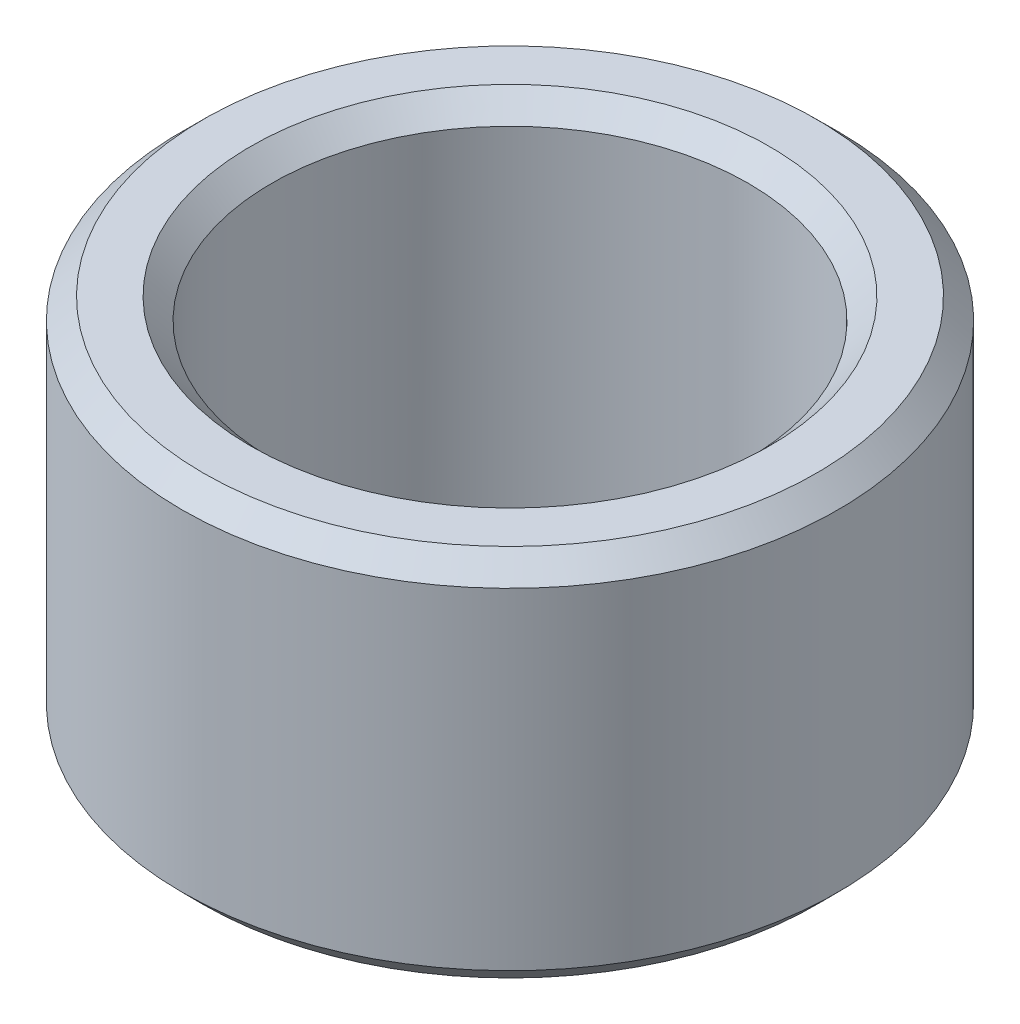
ISO-10303-21;
HEADER;
FILE_DESCRIPTION(('STEP AP214'),'2;1');
FILE_NAME('part.step','',(''),(''),'','','');
FILE_SCHEMA(('AUTOMOTIVE_DESIGN { 1 0 10303 214 1 1 1 1 }'));
ENDSEC;
DATA;
#1=APPLICATION_CONTEXT('core data for automotive mechanical design processes');
#2=APPLICATION_PROTOCOL_DEFINITION('international standard','automotive_design',2000,#1);
#3=PRODUCT_CONTEXT('',#1,'mechanical');
#4=PRODUCT('Part','Part','',(#3));
#5=PRODUCT_RELATED_PRODUCT_CATEGORY('part','',(#4));
#6=PRODUCT_DEFINITION_FORMATION('','',#4);
#7=PRODUCT_DEFINITION_CONTEXT('part definition',#1,'design');
#8=PRODUCT_DEFINITION('design','',#6,#7);
#9=PRODUCT_DEFINITION_SHAPE('','',#8);
#10=(LENGTH_UNIT() NAMED_UNIT(*) SI_UNIT(.MILLI.,.METRE.));
#11=(NAMED_UNIT(*) PLANE_ANGLE_UNIT() SI_UNIT($,.RADIAN.));
#12=(NAMED_UNIT(*) SI_UNIT($,.STERADIAN.) SOLID_ANGLE_UNIT());
#13=UNCERTAINTY_MEASURE_WITH_UNIT(LENGTH_MEASURE(1.E-05),#10,'distance_accuracy_value','');
#14=(GEOMETRIC_REPRESENTATION_CONTEXT(3) GLOBAL_UNCERTAINTY_ASSIGNED_CONTEXT((#13)) GLOBAL_UNIT_ASSIGNED_CONTEXT((#10,
#11,#12)) REPRESENTATION_CONTEXT('',''));
#15=CARTESIAN_POINT('',(0.,0.,0.));
#16=DIRECTION('',(0.,0.,1.));
#17=DIRECTION('',(1.,0.,0.));
#18=AXIS2_PLACEMENT_3D('',#15,#16,#17);
#19=CARTESIAN_POINT('',(0.,28.4884845648745,0.));
#20=DIRECTION('',(0.,-1.,0.));
#21=DIRECTION('',(0.,0.,-1.));
#22=AXIS2_PLACEMENT_3D('',#19,#20,#21);
#23=CYLINDRICAL_SURFACE('',#22,25.);
#24=CARTESIAN_POINT('',(0.,1.6250385084784,0.));
#25=DIRECTION('',(0.,1.,0.));
#26=DIRECTION('',(0.,0.,1.));
#27=AXIS2_PLACEMENT_3D('',#24,#25,#26);
#28=CIRCLE('',#27,25.);
#29=CARTESIAN_POINT('',(0.,1.6250385084784,25.));
#30=VERTEX_POINT('',#29);
#31=EDGE_CURVE('E10',#30,#30,#28,.T.);
#32=ORIENTED_EDGE('',*,*,#31,.T.);
#33=EDGE_LOOP('',(#32));
#34=FACE_BOUND('',#33,.T.);
#35=CARTESIAN_POINT('',(0.,26.8729493379577,0.));
#36=DIRECTION('',(0.,1.,0.));
#37=DIRECTION('',(0.,0.,1.));
#38=AXIS2_PLACEMENT_3D('',#35,#36,#37);
#39=CIRCLE('',#38,25.);
#40=CARTESIAN_POINT('',(0.,26.8729493379577,25.));
#41=VERTEX_POINT('',#40);
#42=EDGE_CURVE('E50',#41,#41,#39,.F.);
#43=ORIENTED_EDGE('',*,*,#42,.T.);
#44=EDGE_LOOP('',(#43));
#45=FACE_BOUND('',#44,.T.);
#46=ADVANCED_FACE('F39',(#34,#45),#23,.T.);
#47=CARTESIAN_POINT('',(0.,28.4884845648745,0.));
#48=DIRECTION('',(0.,1.,0.));
#49=DIRECTION('',(0.,0.,1.));
#50=AXIS2_PLACEMENT_3D('',#47,#48,#49);
#51=PLANE('',#50);
#52=CARTESIAN_POINT('',(0.,28.4884845648745,0.));
#53=DIRECTION('',(0.,1.,0.));
#54=DIRECTION('',(0.,0.,1.));
#55=AXIS2_PLACEMENT_3D('',#52,#53,#54);
#56=CIRCLE('',#55,19.7861685123439);
#57=CARTESIAN_POINT('',(0.,28.4884845648745,19.7861685123439));
#58=VERTEX_POINT('',#57);
#59=EDGE_CURVE('E58',#58,#58,#56,.F.);
#60=ORIENTED_EDGE('',*,*,#59,.T.);
#61=EDGE_LOOP('',(#60));
#62=FACE_BOUND('',#61,.T.);
#63=CARTESIAN_POINT('',(0.,28.4884845648745,0.));
#64=DIRECTION('',(0.,1.,0.));
#65=DIRECTION('',(0.,0.,1.));
#66=AXIS2_PLACEMENT_3D('',#63,#64,#65);
#67=CIRCLE('',#66,23.3749614915216);
#68=CARTESIAN_POINT('',(0.,28.4884845648745,23.3749614915216));
#69=VERTEX_POINT('',#68);
#70=EDGE_CURVE('E61',#69,#69,#67,.T.);
#71=ORIENTED_EDGE('',*,*,#70,.T.);
#72=EDGE_LOOP('',(#71));
#73=FACE_BOUND('',#72,.T.);
#74=ADVANCED_FACE('F88',(#62,#73),#51,.T.);
#75=CARTESIAN_POINT('',(0.,0.,0.));
#76=DIRECTION('',(0.,1.,0.));
#77=DIRECTION('',(0.,0.,1.));
#78=AXIS2_PLACEMENT_3D('',#75,#76,#77);
#79=PLANE('',#78);
#80=CARTESIAN_POINT('',(0.,0.,0.));
#81=DIRECTION('',(0.,1.,0.));
#82=DIRECTION('',(0.,0.,1.));
#83=AXIS2_PLACEMENT_3D('',#80,#81,#82);
#84=CIRCLE('',#83,19.7956717939055);
#85=CARTESIAN_POINT('',(0.,0.,-19.7956717939055));
#86=VERTEX_POINT('',#85);
#87=EDGE_CURVE('E51',#86,#86,#84,.T.);
#88=ORIENTED_EDGE('',*,*,#87,.T.);
#89=EDGE_LOOP('',(#88));
#90=FACE_BOUND('',#89,.T.);
#91=CARTESIAN_POINT('',(0.,0.,0.));
#92=DIRECTION('',(0.,1.,0.));
#93=DIRECTION('',(0.,0.,1.));
#94=AXIS2_PLACEMENT_3D('',#91,#92,#93);
#95=CIRCLE('',#94,23.3844647730832);
#96=CARTESIAN_POINT('',(0.,0.,23.3844647730832));
#97=VERTEX_POINT('',#96);
#98=EDGE_CURVE('E54',#97,#97,#95,.F.);
#99=ORIENTED_EDGE('',*,*,#98,.T.);
#100=EDGE_LOOP('',(#99));
#101=FACE_BOUND('',#100,.T.);
#102=ADVANCED_FACE('F83',(#90,#101),#79,.F.);
#103=CARTESIAN_POINT('',(0.,28.4884845648745,0.));
#104=DIRECTION('',(0.,-1.,0.));
#105=DIRECTION('',(0.,0.,-1.));
#106=AXIS2_PLACEMENT_3D('',#103,#104,#105);
#107=CYLINDRICAL_SURFACE('',#106,18.1706332854271);
#108=CARTESIAN_POINT('',(0.,26.8634460563961,0.));
#109=DIRECTION('',(0.,1.,0.));
#110=DIRECTION('',(0.,0.,1.));
#111=AXIS2_PLACEMENT_3D('',#108,#109,#110);
#112=CIRCLE('',#111,18.1706332854271);
#113=CARTESIAN_POINT('',(0.,26.8634460563961,-18.1706332854271));
#114=VERTEX_POINT('',#113);
#115=EDGE_CURVE('E67',#114,#114,#112,.T.);
#116=CARTESIAN_POINT('',(0.,1.61553522691676,0.));
#117=DIRECTION('',(0.,1.,0.));
#118=DIRECTION('',(0.,0.,1.));
#119=AXIS2_PLACEMENT_3D('',#116,#117,#118);
#120=CIRCLE('',#119,18.1706332854271);
#121=CARTESIAN_POINT('',(0.,1.61553522691676,-18.1706332854271));
#122=VERTEX_POINT('',#121);
#123=EDGE_CURVE('E69',#122,#122,#120,.F.);
#124=CARTESIAN_POINT('',(0.,26.8634460563961,-18.1706332854271));
#125=CARTESIAN_POINT('',(0.,26.6004469852557,-18.1706332854271));
#126=CARTESIAN_POINT('',(0.,26.3374479141152,-18.1706332854271));
#127=CARTESIAN_POINT('',(0.,25.8114497718344,-18.1706332854271));
#128=CARTESIAN_POINT('',(0.,25.548450700694,-18.1706332854271));
#129=CARTESIAN_POINT('',(0.,25.0224525584132,-18.1706332854271));
#130=CARTESIAN_POINT('',(0.,24.7594534872728,-18.1706332854271));
#131=CARTESIAN_POINT('',(0.,24.233455344992,-18.1706332854271));
#132=CARTESIAN_POINT('',(0.,23.9704562738516,-18.1706332854271));
#133=CARTESIAN_POINT('',(0.,23.4444581315707,-18.1706332854271));
#134=CARTESIAN_POINT('',(0.,23.1814590604303,-18.1706332854271));
#135=CARTESIAN_POINT('',(0.,22.6554609181495,-18.1706332854271));
#136=CARTESIAN_POINT('',(0.,22.3924618470091,-18.1706332854271));
#137=CARTESIAN_POINT('',(0.,21.8664637047283,-18.1706332854271));
#138=CARTESIAN_POINT('',(0.,21.6034646335879,-18.1706332854271));
#139=CARTESIAN_POINT('',(0.,21.0774664913071,-18.1706332854271));
#140=CARTESIAN_POINT('',(0.,20.8144674201666,-18.1706332854271));
#141=CARTESIAN_POINT('',(0.,20.2884692778858,-18.1706332854271));
#142=CARTESIAN_POINT('',(0.,20.0254702067454,-18.1706332854271));
#143=CARTESIAN_POINT('',(0.,19.4994720644646,-18.1706332854271));
#144=CARTESIAN_POINT('',(0.,19.2364729933242,-18.1706332854271));
#145=CARTESIAN_POINT('',(0.,18.7104748510434,-18.1706332854271));
#146=CARTESIAN_POINT('',(0.,18.447475779903,-18.1706332854271));
#147=CARTESIAN_POINT('',(0.,17.9214776376221,-18.1706332854271));
#148=CARTESIAN_POINT('',(0.,17.6584785664817,-18.1706332854271));
#149=CARTESIAN_POINT('',(0.,17.1324804242009,-18.1706332854271));
#150=CARTESIAN_POINT('',(0.,16.8694813530605,-18.1706332854271));
#151=CARTESIAN_POINT('',(0.,16.3434832107797,-18.1706332854271));
#152=CARTESIAN_POINT('',(0.,16.0804841396393,-18.1706332854271));
#153=CARTESIAN_POINT('',(0.,15.5544859973585,-18.1706332854271));
#154=CARTESIAN_POINT('',(0.,15.291486926218,-18.1706332854271));
#155=CARTESIAN_POINT('',(0.,14.7654887839372,-18.1706332854271));
#156=CARTESIAN_POINT('',(0.,14.5024897127968,-18.1706332854271));
#157=CARTESIAN_POINT('',(0.,13.976491570516,-18.1706332854271));
#158=CARTESIAN_POINT('',(0.,13.7134924993756,-18.1706332854271));
#159=CARTESIAN_POINT('',(0.,13.1874943570948,-18.1706332854271));
#160=CARTESIAN_POINT('',(0.,12.9244952859544,-18.1706332854271));
#161=CARTESIAN_POINT('',(0.,12.3984971436735,-18.1706332854271));
#162=CARTESIAN_POINT('',(0.,12.1354980725331,-18.1706332854271));
#163=CARTESIAN_POINT('',(0.,11.6094999302523,-18.1706332854271));
#164=CARTESIAN_POINT('',(0.,11.3465008591119,-18.1706332854271));
#165=CARTESIAN_POINT('',(0.,10.8205027168311,-18.1706332854271));
#166=CARTESIAN_POINT('',(0.,10.5575036456907,-18.1706332854271));
#167=CARTESIAN_POINT('',(0.,10.0315055034099,-18.1706332854271));
#168=CARTESIAN_POINT('',(0.,9.76850643226945,-18.1706332854271));
#169=CARTESIAN_POINT('',(0.,9.24250828998863,-18.1706332854271));
#170=CARTESIAN_POINT('',(0.,8.97950921884822,-18.1706332854271));
#171=CARTESIAN_POINT('',(0.,8.45351107656741,-18.1706332854271));
#172=CARTESIAN_POINT('',(0.,8.190512005427,-18.1706332854271));
#173=CARTESIAN_POINT('',(0.,7.66451386314618,-18.1706332854271));
#174=CARTESIAN_POINT('',(0.,7.40151479200577,-18.1706332854271));
#175=CARTESIAN_POINT('',(0.,6.87551664972495,-18.1706332854271));
#176=CARTESIAN_POINT('',(0.,6.61251757858454,-18.1706332854271));
#177=CARTESIAN_POINT('',(0.,6.08651943630372,-18.1706332854271));
#178=CARTESIAN_POINT('',(0.,5.82352036516331,-18.1706332854271));
#179=CARTESIAN_POINT('',(0.,5.29752222288249,-18.1706332854271));
#180=CARTESIAN_POINT('',(0.,5.03452315174209,-18.1706332854271));
#181=CARTESIAN_POINT('',(0.,4.50852500946127,-18.1706332854271));
#182=CARTESIAN_POINT('',(0.,4.24552593832086,-18.1706332854271));
#183=CARTESIAN_POINT('',(0.,3.71952779604004,-18.1706332854271));
#184=CARTESIAN_POINT('',(0.,3.45652872489963,-18.1706332854271));
#185=CARTESIAN_POINT('',(0.,2.93053058261881,-18.1706332854271));
#186=CARTESIAN_POINT('',(0.,2.6675315114784,-18.1706332854271));
#187=CARTESIAN_POINT('',(0.,2.14153336919758,-18.1706332854271));
#188=CARTESIAN_POINT('',(0.,1.87853429805717,-18.1706332854271));
#189=CARTESIAN_POINT('',(0.,1.61553522691676,-18.1706332854271));
#190=B_SPLINE_CURVE_WITH_KNOTS('',3,(#124,#125,#126,#127,#128,#129,#130,#131,#132,#133,#134,
#135,#136,#137,#138,#139,#140,#141,#142,#143,#144,#145,#146,#147,#148,#149,#150,#151,#152,#153,
#154,#155,#156,#157,#158,#159,#160,#161,#162,#163,#164,#165,#166,#167,#168,#169,#170,#171,#172,
#173,#174,#175,#176,#177,#178,#179,#180,#181,#182,#183,#184,#185,#186,#187,#188,#189),
.UNSPECIFIED.,.F.,.F.,(4,2,2,2,2,2,2,2,2,2,2,2,2,2,2,2,2,2,2,2,2,2,2,2,2,2,2,2,2,2,2,2,4),(0.,
0.788997213421232,1.57799442684246,2.36699164026368,3.15598885368491,3.94498606710614,
4.73398328052737,5.5229804939486,6.31197770736983,7.10097492079105,7.88997213421228,
8.67896934763351,9.46796656105474,10.256963774476,11.0459609878972,11.8349582013184,
12.6239554147396,13.4129526281609,14.2019498415821,14.9909470550033,15.7799442684246,
16.5689414818458,17.357938695267,18.1469359086882,18.9359331221095,19.7249303355307,
20.5139275489519,21.3029247623732,22.0919219757944,22.8809191892156,23.6699164026368,
24.4589136160581,25.2479108294793),.UNSPECIFIED.);
#191=EDGE_CURVE('BSEAM71',#114,#122,#190,.T.);
#192=ORIENTED_EDGE('',*,*,#115,.T.);
#193=ORIENTED_EDGE('',*,*,#123,.T.);
#194=ORIENTED_EDGE('',*,*,#191,.T.);
#195=ORIENTED_EDGE('',*,*,#191,.F.);
#196=EDGE_LOOP('',(#192,#194,#193,#195));
#197=FACE_BOUND('',#196,.T.);
#198=ADVANCED_FACE('F71',(#197),#107,.F.);
#199=CARTESIAN_POINT('',(0.,26.8634460563961,0.));
#200=DIRECTION('',(0.,1.,0.));
#201=DIRECTION('',(0.,0.,1.));
#202=AXIS2_PLACEMENT_3D('',#199,#200,#201);
#203=CONICAL_SURFACE('',#202,18.1706332854271,0.782465579511168);
#204=ORIENTED_EDGE('',*,*,#59,.F.);
#205=EDGE_LOOP('',(#204));
#206=FACE_BOUND('',#205,.T.);
#207=ORIENTED_EDGE('',*,*,#115,.F.);
#208=EDGE_LOOP('',(#207));
#209=FACE_BOUND('',#208,.T.);
#210=ADVANCED_FACE('F77',(#206,#209),#203,.F.);
#211=CARTESIAN_POINT('',(0.,0.,0.));
#212=DIRECTION('',(0.,-1.,0.));
#213=DIRECTION('',(0.,0.,-1.));
#214=AXIS2_PLACEMENT_3D('',#211,#212,#213);
#215=CONICAL_SURFACE('',#214,19.7956717939055,0.788330747283729);
#216=CARTESIAN_POINT('',(0.,1.61553522691676,-18.1706332854271));
#217=CARTESIAN_POINT('',(0.,1.59870673496971,-18.1875607698904));
#218=CARTESIAN_POINT('',(0.,1.58187824302266,-18.2044882543537));
#219=CARTESIAN_POINT('',(0.,1.54822125912857,-18.2383432232803));
#220=CARTESIAN_POINT('',(0.,1.53139276718152,-18.2552707077437));
#221=CARTESIAN_POINT('',(0.,1.49773578328742,-18.2891256766703));
#222=CARTESIAN_POINT('',(0.,1.48090729134037,-18.3060531611336));
#223=CARTESIAN_POINT('',(0.,1.44725030744627,-18.3399081300602));
#224=CARTESIAN_POINT('',(0.,1.43042181549922,-18.3568356145236));
#225=CARTESIAN_POINT('',(0.,1.39676483160512,-18.3906905834502));
#226=CARTESIAN_POINT('',(0.,1.37993633965807,-18.4076180679135));
#227=CARTESIAN_POINT('',(0.,1.34627935576397,-18.4414730368401));
#228=CARTESIAN_POINT('',(0.,1.32945086381692,-18.4584005213035));
#229=CARTESIAN_POINT('',(0.,1.29579387992282,-18.4922554902301));
#230=CARTESIAN_POINT('',(0.,1.27896538797577,-18.5091829746934));
#231=CARTESIAN_POINT('',(0.,1.24530840408167,-18.54303794362));
#232=CARTESIAN_POINT('',(0.,1.22847991213462,-18.5599654280834));
#233=CARTESIAN_POINT('',(0.,1.19482292824052,-18.59382039701));
#234=CARTESIAN_POINT('',(0.,1.17799443629347,-18.6107478814733));
#235=CARTESIAN_POINT('',(0.,1.14433745239937,-18.6446028503999));
#236=CARTESIAN_POINT('',(0.,1.12750896045232,-18.6615303348633));
#237=CARTESIAN_POINT('',(0.,1.09385197655823,-18.6953853037899));
#238=CARTESIAN_POINT('',(0.,1.07702348461118,-18.7123127882532));
#239=CARTESIAN_POINT('',(0.,1.04336650071708,-18.7461677571798));
#240=CARTESIAN_POINT('',(0.,1.02653800877003,-18.7630952416432));
#241=CARTESIAN_POINT('',(0.,0.992881024875928,-18.7969502105698));
#242=CARTESIAN_POINT('',(0.,0.976052532928878,-18.8138776950331));
#243=CARTESIAN_POINT('',(0.,0.942395549034779,-18.8477326639597));
#244=CARTESIAN_POINT('',(0.,0.92556705708773,-18.8646601484231));
#245=CARTESIAN_POINT('',(0.,0.89191007319363,-18.8985151173497));
#246=CARTESIAN_POINT('',(0.,0.87508158124658,-18.915442601813));
#247=CARTESIAN_POINT('',(0.,0.841424597352481,-18.9492975707396));
#248=CARTESIAN_POINT('',(0.,0.824596105405432,-18.966225055203));
#249=CARTESIAN_POINT('',(0.,0.790939121511333,-19.0000800241296));
#250=CARTESIAN_POINT('',(0.,0.774110629564283,-19.0170075085929));
#251=CARTESIAN_POINT('',(0.,0.740453645670184,-19.0508624775195));
#252=CARTESIAN_POINT('',(0.,0.723625153723134,-19.0677899619829));
#253=CARTESIAN_POINT('',(0.,0.689968169829035,-19.1016449309095));
#254=CARTESIAN_POINT('',(0.,0.673139677881985,-19.1185724153728));
#255=CARTESIAN_POINT('',(0.,0.639482693987886,-19.1524273842994));
#256=CARTESIAN_POINT('',(0.,0.622654202040836,-19.1693548687628));
#257=CARTESIAN_POINT('',(0.,0.588997218146737,-19.2032098376894));
#258=CARTESIAN_POINT('',(0.,0.572168726199687,-19.2201373221527));
#259=CARTESIAN_POINT('',(0.,0.538511742305588,-19.2539922910793));
#260=CARTESIAN_POINT('',(0.,0.521683250358538,-19.2709197755427));
#261=CARTESIAN_POINT('',(0.,0.488026266464439,-19.3047747444693));
#262=CARTESIAN_POINT('',(0.,0.47119777451739,-19.3217022289326));
#263=CARTESIAN_POINT('',(0.,0.43754079062329,-19.3555571978592));
#264=CARTESIAN_POINT('',(0.,0.420712298676241,-19.3724846823226));
#265=CARTESIAN_POINT('',(0.,0.387055314782141,-19.4063396512492));
#266=CARTESIAN_POINT('',(0.,0.370226822835092,-19.4232671357125));
#267=CARTESIAN_POINT('',(0.,0.336569838940993,-19.4571221046391));
#268=CARTESIAN_POINT('',(0.,0.319741346993943,-19.4740495891025));
#269=CARTESIAN_POINT('',(0.,0.286084363099844,-19.5079045580291));
#270=CARTESIAN_POINT('',(0.,0.269255871152794,-19.5248320424924));
#271=CARTESIAN_POINT('',(0.,0.235598887258695,-19.558687011419));
#272=CARTESIAN_POINT('',(0.,0.218770395311645,-19.5756144958824));
#273=CARTESIAN_POINT('',(0.,0.185113411417546,-19.609469464809));
#274=CARTESIAN_POINT('',(0.,0.168284919470496,-19.6263969492723));
#275=CARTESIAN_POINT('',(0.,0.134627935576397,-19.6602519181989));
#276=CARTESIAN_POINT('',(0.,0.117799443629347,-19.6771794026623));
#277=CARTESIAN_POINT('',(0.,0.0841424597352481,-19.7110343715889));
#278=CARTESIAN_POINT('',(0.,0.0673139677881985,-19.7279618560522));
#279=CARTESIAN_POINT('',(0.,0.0336569838940992,-19.7618168249788));
#280=CARTESIAN_POINT('',(0.,0.0168284919470496,-19.7787443094422));
#281=CARTESIAN_POINT('',(0.,0.,-19.7956717939055));
#282=B_SPLINE_CURVE_WITH_KNOTS('',3,(#216,#217,#218,#219,#220,#221,#222,#223,#224,#225,#226,
#227,#228,#229,#230,#231,#232,#233,#234,#235,#236,#237,#238,#239,#240,#241,#242,#243,#244,#245,
#246,#247,#248,#249,#250,#251,#252,#253,#254,#255,#256,#257,#258,#259,#260,#261,#262,#263,#264,
#265,#266,#267,#268,#269,#270,#271,#272,#273,#274,#275,#276,#277,#278,#279,#280,#281),
.UNSPECIFIED.,.F.,.F.,(4,2,2,2,2,2,2,2,2,2,2,2,2,2,2,2,2,2,2,2,2,2,2,2,2,2,2,2,2,2,2,2,4),(0.,
0.0716075473899899,0.14321509477998,0.21482264216997,0.28643018955996,0.35803773694995,
0.429645284339939,0.501252831729929,0.572860379119919,0.644467926509909,0.716075473899899,
0.787683021289889,0.859290568679879,0.930898116069869,1.00250566345986,1.07411321084985,
1.14572075823984,1.21732830562983,1.28893585301982,1.36054340040981,1.4321509477998,
1.50375849518979,1.57536604257978,1.64697358996977,1.71858113735976,1.79018868474975,
1.86179623213974,1.93340377952973,2.00501132691972,2.07661887430971,2.1482264216997,
2.21983396908969,2.29144151647968),.UNSPECIFIED.);
#283=EDGE_CURVE('BSEAM73',#122,#86,#282,.T.);
#284=ORIENTED_EDGE('',*,*,#123,.F.);
#285=ORIENTED_EDGE('',*,*,#87,.F.);
#286=ORIENTED_EDGE('',*,*,#283,.T.);
#287=ORIENTED_EDGE('',*,*,#283,.F.);
#288=EDGE_LOOP('',(#284,#286,#285,#287));
#289=FACE_BOUND('',#288,.T.);
#290=ADVANCED_FACE('F73',(#289),#215,.F.);
#291=CARTESIAN_POINT('',(0.,1.6250385084784,0.));
#292=DIRECTION('',(0.,1.,0.));
#293=DIRECTION('',(0.,0.,1.));
#294=AXIS2_PLACEMENT_3D('',#291,#292,#293);
#295=CONICAL_SURFACE('',#294,25.,0.782465579511167);
#296=ORIENTED_EDGE('',*,*,#98,.F.);
#297=EDGE_LOOP('',(#296));
#298=FACE_BOUND('',#297,.T.);
#299=ORIENTED_EDGE('',*,*,#31,.F.);
#300=EDGE_LOOP('',(#299));
#301=FACE_BOUND('',#300,.T.);
#302=ADVANCED_FACE('F76',(#298,#301),#295,.T.);
#303=CARTESIAN_POINT('',(0.,28.4884845648745,0.));
#304=DIRECTION('',(0.,-1.,0.));
#305=DIRECTION('',(0.,0.,-1.));
#306=AXIS2_PLACEMENT_3D('',#303,#304,#305);
#307=CONICAL_SURFACE('',#306,23.3749614915216,0.788330747283727);
#308=ORIENTED_EDGE('',*,*,#42,.F.);
#309=EDGE_LOOP('',(#308));
#310=FACE_BOUND('',#309,.T.);
#311=ORIENTED_EDGE('',*,*,#70,.F.);
#312=EDGE_LOOP('',(#311));
#313=FACE_BOUND('',#312,.T.);
#314=ADVANCED_FACE('F45',(#310,#313),#307,.T.);
#315=CLOSED_SHELL('',(#46,#74,#102,#198,#210,#290,#302,#314));
#316=MANIFOLD_SOLID_BREP('B2',#315);
#317=ADVANCED_BREP_SHAPE_REPRESENTATION('',(#18,#316),#14);
#318=SHAPE_DEFINITION_REPRESENTATION(#9,#317);
ENDSEC;
END-ISO-10303-21;
